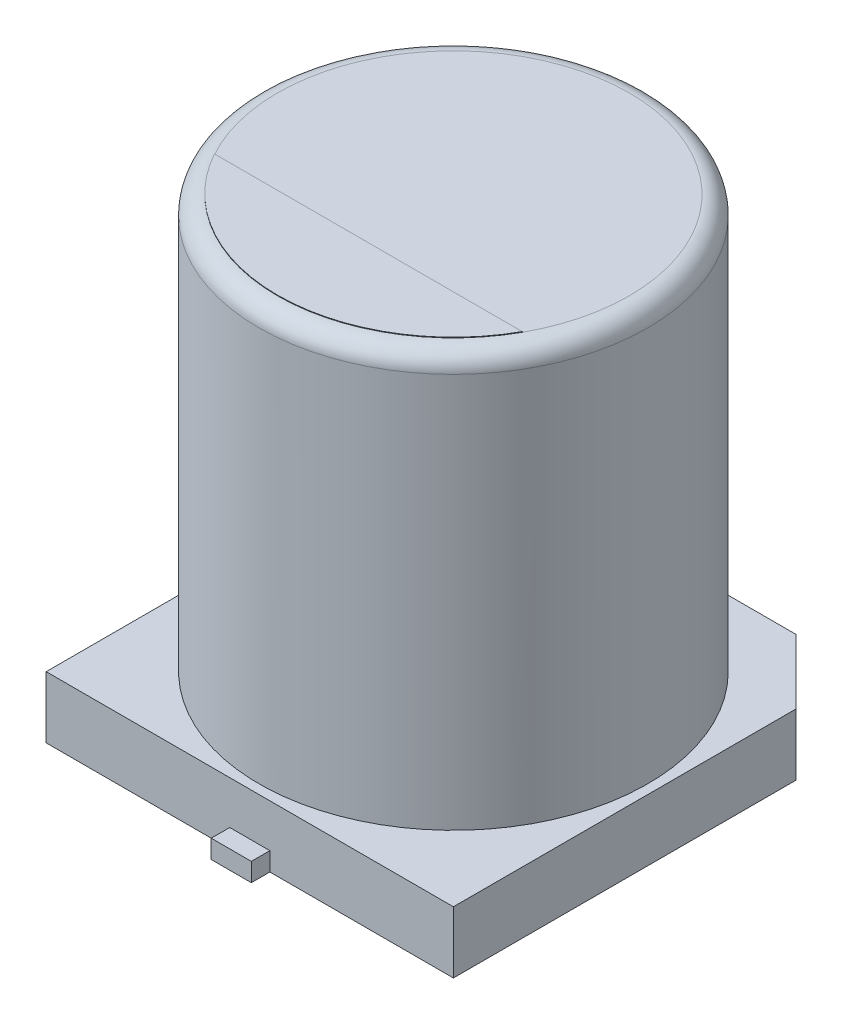
ISO-10303-21;
HEADER;
FILE_DESCRIPTION(('STEP AP214'),'2;1');
FILE_NAME('part.step','',(''),(''),'','','');
FILE_SCHEMA(('AUTOMOTIVE_DESIGN { 1 0 10303 214 1 1 1 1 }'));
ENDSEC;
DATA;
#1=APPLICATION_CONTEXT('core data for automotive mechanical design processes');
#2=APPLICATION_PROTOCOL_DEFINITION('international standard','automotive_design',2000,#1);
#3=PRODUCT_CONTEXT('',#1,'mechanical');
#4=PRODUCT('Part','Part','',(#3));
#5=PRODUCT_RELATED_PRODUCT_CATEGORY('part','',(#4));
#6=PRODUCT_DEFINITION_FORMATION('','',#4);
#7=PRODUCT_DEFINITION_CONTEXT('part definition',#1,'design');
#8=PRODUCT_DEFINITION('design','',#6,#7);
#9=PRODUCT_DEFINITION_SHAPE('','',#8);
#10=(LENGTH_UNIT() NAMED_UNIT(*) SI_UNIT(.MILLI.,.METRE.));
#11=(NAMED_UNIT(*) PLANE_ANGLE_UNIT() SI_UNIT($,.RADIAN.));
#12=(NAMED_UNIT(*) SI_UNIT($,.STERADIAN.) SOLID_ANGLE_UNIT());
#13=UNCERTAINTY_MEASURE_WITH_UNIT(LENGTH_MEASURE(1.E-05),#10,'distance_accuracy_value','');
#14=(GEOMETRIC_REPRESENTATION_CONTEXT(3) GLOBAL_UNCERTAINTY_ASSIGNED_CONTEXT((#13)) GLOBAL_UNIT_ASSIGNED_CONTEXT((#10,
#11,#12)) REPRESENTATION_CONTEXT('',''));
#15=CARTESIAN_POINT('',(0.,0.,0.));
#16=DIRECTION('',(0.,0.,1.));
#17=DIRECTION('',(1.,0.,0.));
#18=AXIS2_PLACEMENT_3D('',#15,#16,#17);
#19=CARTESIAN_POINT('',(0.,7.7,0.));
#20=DIRECTION('',(0.,1.,0.));
#21=DIRECTION('',(0.,0.,1.));
#22=AXIS2_PLACEMENT_3D('',#19,#20,#21);
#23=PLANE('',#22);
#24=CARTESIAN_POINT('',(0.,7.7,0.));
#25=DIRECTION('',(0.,1.,0.));
#26=DIRECTION('',(0.,0.,1.));
#27=AXIS2_PLACEMENT_3D('',#24,#25,#26);
#28=CIRCLE('',#27,2.85);
#29=CARTESIAN_POINT('',(2.4945818621303,7.7,1.37824574482584));
#30=VERTEX_POINT('',#29);
#31=CARTESIAN_POINT('',(-2.4945818621303,7.7,1.37824574482584));
#32=VERTEX_POINT('',#31);
#33=EDGE_CURVE('E221',#30,#32,#28,.T.);
#34=ORIENTED_EDGE('',*,*,#33,.T.);
#35=DIRECTION('',(-1.,0.,0.));
#36=VECTOR('',#35,1.);
#37=CARTESIAN_POINT('',(-2.4945818621303,7.7,1.37824574482584));
#38=LINE('',#37,#36);
#39=EDGE_CURVE('E159',#30,#32,#38,.T.);
#40=ORIENTED_EDGE('',*,*,#39,.F.);
#41=EDGE_LOOP('',(#34,#40));
#42=FACE_BOUND('',#41,.T.);
#43=ADVANCED_FACE('F33',(#42),#23,.T.);
#44=CARTESIAN_POINT('',(-2.25,1.,-3.3));
#45=DIRECTION('',(0.,0.,1.));
#46=DIRECTION('',(1.,0.,0.));
#47=AXIS2_PLACEMENT_3D('',#44,#45,#46);
#48=PLANE('',#47);
#49=DIRECTION('',(0.,-1.,0.));
#50=VECTOR('',#49,1.);
#51=CARTESIAN_POINT('',(0.325,1.,-3.3));
#52=LINE('',#51,#50);
#53=CARTESIAN_POINT('',(0.325,0.3,-3.3));
#54=VERTEX_POINT('',#53);
#55=CARTESIAN_POINT('',(0.325,0.,-3.3));
#56=VERTEX_POINT('',#55);
#57=EDGE_CURVE('E188',#54,#56,#52,.T.);
#58=ORIENTED_EDGE('',*,*,#57,.F.);
#59=DIRECTION('',(-1.,0.,0.));
#60=VECTOR('',#59,1.);
#61=CARTESIAN_POINT('',(-2.25,0.3,-3.3));
#62=LINE('',#61,#60);
#63=CARTESIAN_POINT('',(-0.325,0.3,-3.3));
#64=VERTEX_POINT('',#63);
#65=EDGE_CURVE('E11',#54,#64,#62,.T.);
#66=ORIENTED_EDGE('',*,*,#65,.T.);
#67=DIRECTION('',(0.,1.,0.));
#68=VECTOR('',#67,1.);
#69=CARTESIAN_POINT('',(-0.325,1.,-3.3));
#70=LINE('',#69,#68);
#71=CARTESIAN_POINT('',(-0.325,0.,-3.3));
#72=VERTEX_POINT('',#71);
#73=EDGE_CURVE('E186',#72,#64,#70,.T.);
#74=ORIENTED_EDGE('',*,*,#73,.F.);
#75=DIRECTION('',(-1.,0.,0.));
#76=VECTOR('',#75,1.);
#77=CARTESIAN_POINT('',(-2.25,0.,-3.3));
#78=LINE('',#77,#76);
#79=CARTESIAN_POINT('',(-2.25,0.,-3.3));
#80=VERTEX_POINT('',#79);
#81=EDGE_CURVE('E242',#72,#80,#78,.T.);
#82=ORIENTED_EDGE('',*,*,#81,.T.);
#83=DIRECTION('',(0.,-1.,0.));
#84=VECTOR('',#83,1.);
#85=CARTESIAN_POINT('',(-2.25,1.,-3.3));
#86=LINE('',#85,#84);
#87=CARTESIAN_POINT('',(-2.25,1.,-3.3));
#88=VERTEX_POINT('',#87);
#89=EDGE_CURVE('E259',#88,#80,#86,.T.);
#90=ORIENTED_EDGE('',*,*,#89,.F.);
#91=DIRECTION('',(-1.,0.,0.));
#92=VECTOR('',#91,1.);
#93=CARTESIAN_POINT('',(-2.25,1.,-3.3));
#94=LINE('',#93,#92);
#95=CARTESIAN_POINT('',(2.25,1.,-3.3));
#96=VERTEX_POINT('',#95);
#97=EDGE_CURVE('E229',#96,#88,#94,.T.);
#98=ORIENTED_EDGE('',*,*,#97,.F.);
#99=DIRECTION('',(0.,-1.,0.));
#100=VECTOR('',#99,1.);
#101=CARTESIAN_POINT('',(2.25,1.,-3.3));
#102=LINE('',#101,#100);
#103=CARTESIAN_POINT('',(2.25,0.,-3.3));
#104=VERTEX_POINT('',#103);
#105=EDGE_CURVE('E262',#96,#104,#102,.T.);
#106=ORIENTED_EDGE('',*,*,#105,.T.);
#107=EDGE_CURVE('E243',#104,#56,#78,.T.);
#108=ORIENTED_EDGE('',*,*,#107,.T.);
#109=EDGE_LOOP('',(#58,#66,#74,#82,#90,#98,#106,#108));
#110=FACE_BOUND('',#109,.T.);
#111=ADVANCED_FACE('F319',(#110),#48,.F.);
#112=CARTESIAN_POINT('',(3.3,1.,3.3));
#113=DIRECTION('',(0.,0.,-1.));
#114=DIRECTION('',(-1.,0.,0.));
#115=AXIS2_PLACEMENT_3D('',#112,#113,#114);
#116=PLANE('',#115);
#117=DIRECTION('',(0.,-1.,0.));
#118=VECTOR('',#117,1.);
#119=CARTESIAN_POINT('',(-0.325,1.,3.3));
#120=LINE('',#119,#118);
#121=CARTESIAN_POINT('',(-0.325,0.3,3.3));
#122=VERTEX_POINT('',#121);
#123=CARTESIAN_POINT('',(-0.325,0.,3.3));
#124=VERTEX_POINT('',#123);
#125=EDGE_CURVE('E214',#122,#124,#120,.T.);
#126=ORIENTED_EDGE('',*,*,#125,.F.);
#127=DIRECTION('',(-1.,0.,0.));
#128=VECTOR('',#127,1.);
#129=CARTESIAN_POINT('',(3.3,0.3,3.3));
#130=LINE('',#129,#128);
#131=CARTESIAN_POINT('',(0.325,0.3,3.3));
#132=VERTEX_POINT('',#131);
#133=EDGE_CURVE('E41',#132,#122,#130,.T.);
#134=ORIENTED_EDGE('',*,*,#133,.F.);
#135=DIRECTION('',(0.,1.,0.));
#136=VECTOR('',#135,1.);
#137=CARTESIAN_POINT('',(0.325,1.,3.3));
#138=LINE('',#137,#136);
#139=CARTESIAN_POINT('',(0.325,0.,3.3));
#140=VERTEX_POINT('',#139);
#141=EDGE_CURVE('E211',#140,#132,#138,.T.);
#142=ORIENTED_EDGE('',*,*,#141,.F.);
#143=DIRECTION('',(1.,0.,0.));
#144=VECTOR('',#143,1.);
#145=CARTESIAN_POINT('',(3.3,0.,3.3));
#146=LINE('',#145,#144);
#147=CARTESIAN_POINT('',(3.3,0.,3.3));
#148=VERTEX_POINT('',#147);
#149=EDGE_CURVE('E249',#140,#148,#146,.T.);
#150=ORIENTED_EDGE('',*,*,#149,.T.);
#151=DIRECTION('',(0.,-1.,0.));
#152=VECTOR('',#151,1.);
#153=CARTESIAN_POINT('',(3.3,1.,3.3));
#154=LINE('',#153,#152);
#155=CARTESIAN_POINT('',(3.3,1.,3.3));
#156=VERTEX_POINT('',#155);
#157=EDGE_CURVE('E237',#156,#148,#154,.T.);
#158=ORIENTED_EDGE('',*,*,#157,.F.);
#159=DIRECTION('',(1.,0.,0.));
#160=VECTOR('',#159,1.);
#161=CARTESIAN_POINT('',(3.3,1.,3.3));
#162=LINE('',#161,#160);
#163=CARTESIAN_POINT('',(-3.3,1.,3.3));
#164=VERTEX_POINT('',#163);
#165=EDGE_CURVE('E235',#164,#156,#162,.T.);
#166=ORIENTED_EDGE('',*,*,#165,.F.);
#167=DIRECTION('',(0.,-1.,0.));
#168=VECTOR('',#167,1.);
#169=CARTESIAN_POINT('',(-3.3,1.,3.3));
#170=LINE('',#169,#168);
#171=CARTESIAN_POINT('',(-3.3,0.,3.3));
#172=VERTEX_POINT('',#171);
#173=EDGE_CURVE('E253',#164,#172,#170,.T.);
#174=ORIENTED_EDGE('',*,*,#173,.T.);
#175=EDGE_CURVE('E227',#172,#124,#146,.T.);
#176=ORIENTED_EDGE('',*,*,#175,.T.);
#177=EDGE_LOOP('',(#126,#134,#142,#150,#158,#166,#174,#176));
#178=FACE_BOUND('',#177,.T.);
#179=ADVANCED_FACE('F289',(#178),#116,.F.);
#180=CARTESIAN_POINT('',(3.3,1.,-2.25));
#181=DIRECTION('',(-1.,0.,0.));
#182=DIRECTION('',(0.,0.,1.));
#183=AXIS2_PLACEMENT_3D('',#180,#181,#182);
#184=PLANE('',#183);
#185=DIRECTION('',(0.,0.,-1.));
#186=VECTOR('',#185,1.);
#187=CARTESIAN_POINT('',(3.3,0.,-2.25));
#188=LINE('',#187,#186);
#189=CARTESIAN_POINT('',(3.3,0.,-2.25));
#190=VERTEX_POINT('',#189);
#191=EDGE_CURVE('E217',#148,#190,#188,.T.);
#192=ORIENTED_EDGE('',*,*,#191,.T.);
#193=DIRECTION('',(0.,-1.,0.));
#194=VECTOR('',#193,1.);
#195=CARTESIAN_POINT('',(3.3,1.,-2.25));
#196=LINE('',#195,#194);
#197=CARTESIAN_POINT('',(3.3,1.,-2.25));
#198=VERTEX_POINT('',#197);
#199=EDGE_CURVE('E222',#198,#190,#196,.T.);
#200=ORIENTED_EDGE('',*,*,#199,.F.);
#201=DIRECTION('',(0.,0.,-1.));
#202=VECTOR('',#201,1.);
#203=CARTESIAN_POINT('',(3.3,1.,-2.25));
#204=LINE('',#203,#202);
#205=EDGE_CURVE('E223',#156,#198,#204,.T.);
#206=ORIENTED_EDGE('',*,*,#205,.F.);
#207=ORIENTED_EDGE('',*,*,#157,.T.);
#208=EDGE_LOOP('',(#192,#200,#206,#207));
#209=FACE_BOUND('',#208,.T.);
#210=ADVANCED_FACE('F296',(#209),#184,.F.);
#211=CARTESIAN_POINT('',(2.25,1.,-3.3));
#212=DIRECTION('',(-0.707106781186548,0.,0.707106781186547));
#213=DIRECTION('',(0.707106781186547,0.,0.707106781186548));
#214=AXIS2_PLACEMENT_3D('',#211,#212,#213);
#215=PLANE('',#214);
#216=DIRECTION('',(-0.707106781186547,0.,-0.707106781186548));
#217=VECTOR('',#216,1.);
#218=CARTESIAN_POINT('',(2.25,0.,-3.3));
#219=LINE('',#218,#217);
#220=EDGE_CURVE('E240',#190,#104,#219,.T.);
#221=ORIENTED_EDGE('',*,*,#220,.T.);
#222=ORIENTED_EDGE('',*,*,#105,.F.);
#223=DIRECTION('',(-0.707106781186547,0.,-0.707106781186548));
#224=VECTOR('',#223,1.);
#225=CARTESIAN_POINT('',(2.25,1.,-3.3));
#226=LINE('',#225,#224);
#227=EDGE_CURVE('E226',#198,#96,#226,.T.);
#228=ORIENTED_EDGE('',*,*,#227,.F.);
#229=ORIENTED_EDGE('',*,*,#199,.T.);
#230=EDGE_LOOP('',(#221,#222,#228,#229));
#231=FACE_BOUND('',#230,.T.);
#232=ADVANCED_FACE('F303',(#231),#215,.F.);
#233=CARTESIAN_POINT('',(-3.3,1.,-2.25));
#234=DIRECTION('',(0.707106781186547,0.,0.707106781186547));
#235=DIRECTION('',(0.707106781186548,0.,-0.707106781186548));
#236=AXIS2_PLACEMENT_3D('',#233,#234,#235);
#237=PLANE('',#236);
#238=DIRECTION('',(-0.707106781186548,0.,0.707106781186548));
#239=VECTOR('',#238,1.);
#240=CARTESIAN_POINT('',(-3.3,0.,-2.25));
#241=LINE('',#240,#239);
#242=CARTESIAN_POINT('',(-3.3,0.,-2.25));
#243=VERTEX_POINT('',#242);
#244=EDGE_CURVE('E245',#80,#243,#241,.T.);
#245=ORIENTED_EDGE('',*,*,#244,.T.);
#246=DIRECTION('',(0.,-1.,0.));
#247=VECTOR('',#246,1.);
#248=CARTESIAN_POINT('',(-3.3,1.,-2.25));
#249=LINE('',#248,#247);
#250=CARTESIAN_POINT('',(-3.3,1.,-2.25));
#251=VERTEX_POINT('',#250);
#252=EDGE_CURVE('E256',#251,#243,#249,.T.);
#253=ORIENTED_EDGE('',*,*,#252,.F.);
#254=DIRECTION('',(-0.707106781186548,0.,0.707106781186548));
#255=VECTOR('',#254,1.);
#256=CARTESIAN_POINT('',(-3.3,1.,-2.25));
#257=LINE('',#256,#255);
#258=EDGE_CURVE('E231',#88,#251,#257,.T.);
#259=ORIENTED_EDGE('',*,*,#258,.F.);
#260=ORIENTED_EDGE('',*,*,#89,.T.);
#261=EDGE_LOOP('',(#245,#253,#259,#260));
#262=FACE_BOUND('',#261,.T.);
#263=ADVANCED_FACE('F317',(#262),#237,.F.);
#264=CARTESIAN_POINT('',(-3.3,1.,3.3));
#265=DIRECTION('',(1.,0.,0.));
#266=DIRECTION('',(0.,0.,-1.));
#267=AXIS2_PLACEMENT_3D('',#264,#265,#266);
#268=PLANE('',#267);
#269=DIRECTION('',(0.,0.,1.));
#270=VECTOR('',#269,1.);
#271=CARTESIAN_POINT('',(-3.3,0.,3.3));
#272=LINE('',#271,#270);
#273=EDGE_CURVE('E247',#243,#172,#272,.T.);
#274=ORIENTED_EDGE('',*,*,#273,.T.);
#275=ORIENTED_EDGE('',*,*,#173,.F.);
#276=DIRECTION('',(0.,0.,1.));
#277=VECTOR('',#276,1.);
#278=CARTESIAN_POINT('',(-3.3,1.,3.3));
#279=LINE('',#278,#277);
#280=EDGE_CURVE('E233',#251,#164,#279,.T.);
#281=ORIENTED_EDGE('',*,*,#280,.F.);
#282=ORIENTED_EDGE('',*,*,#252,.T.);
#283=EDGE_LOOP('',(#274,#275,#281,#282));
#284=FACE_BOUND('',#283,.T.);
#285=ADVANCED_FACE('F313',(#284),#268,.F.);
#286=CARTESIAN_POINT('',(0.,1.,0.));
#287=DIRECTION('',(0.,-1.,0.));
#288=DIRECTION('',(0.,0.,-1.));
#289=AXIS2_PLACEMENT_3D('',#286,#287,#288);
#290=PLANE('',#289);
#291=CARTESIAN_POINT('',(0.,1.,0.));
#292=DIRECTION('',(0.,-1.,0.));
#293=DIRECTION('',(0.,0.,-1.));
#294=AXIS2_PLACEMENT_3D('',#291,#292,#293);
#295=CIRCLE('',#294,3.15);
#296=CARTESIAN_POINT('',(0.,1.,-3.15));
#297=VERTEX_POINT('',#296);
#298=EDGE_CURVE('E218',#297,#297,#295,.F.);
#299=ORIENTED_EDGE('',*,*,#298,.F.);
#300=EDGE_LOOP('',(#299));
#301=FACE_BOUND('',#300,.T.);
#302=ORIENTED_EDGE('',*,*,#205,.T.);
#303=ORIENTED_EDGE('',*,*,#227,.T.);
#304=ORIENTED_EDGE('',*,*,#97,.T.);
#305=ORIENTED_EDGE('',*,*,#258,.T.);
#306=ORIENTED_EDGE('',*,*,#280,.T.);
#307=ORIENTED_EDGE('',*,*,#165,.T.);
#308=EDGE_LOOP('',(#302,#303,#304,#305,#306,#307));
#309=FACE_BOUND('',#308,.T.);
#310=ADVANCED_FACE('F306',(#301,#309),#290,.F.);
#311=CARTESIAN_POINT('',(0.,0.,0.));
#312=DIRECTION('',(0.,-1.,0.));
#313=DIRECTION('',(0.,0.,-1.));
#314=AXIS2_PLACEMENT_3D('',#311,#312,#313);
#315=PLANE('',#314);
#316=ORIENTED_EDGE('',*,*,#81,.F.);
#317=DIRECTION('',(0.,0.,1.));
#318=VECTOR('',#317,1.);
#319=CARTESIAN_POINT('',(-0.325,0.,-0.8));
#320=LINE('',#319,#318);
#321=CARTESIAN_POINT('',(-0.325,0.,-3.6));
#322=VERTEX_POINT('',#321);
#323=EDGE_CURVE('E172',#322,#72,#320,.T.);
#324=ORIENTED_EDGE('',*,*,#323,.F.);
#325=DIRECTION('',(-1.,0.,0.));
#326=VECTOR('',#325,1.);
#327=CARTESIAN_POINT('',(0.325,0.,-3.6));
#328=LINE('',#327,#326);
#329=CARTESIAN_POINT('',(0.325,0.,-3.6));
#330=VERTEX_POINT('',#329);
#331=EDGE_CURVE('E164',#330,#322,#328,.T.);
#332=ORIENTED_EDGE('',*,*,#331,.F.);
#333=DIRECTION('',(0.,0.,-1.));
#334=VECTOR('',#333,1.);
#335=CARTESIAN_POINT('',(0.325,0.,-0.8));
#336=LINE('',#335,#334);
#337=EDGE_CURVE('E162',#56,#330,#336,.T.);
#338=ORIENTED_EDGE('',*,*,#337,.F.);
#339=ORIENTED_EDGE('',*,*,#107,.F.);
#340=ORIENTED_EDGE('',*,*,#220,.F.);
#341=ORIENTED_EDGE('',*,*,#191,.F.);
#342=ORIENTED_EDGE('',*,*,#149,.F.);
#343=DIRECTION('',(0.,0.,-1.));
#344=VECTOR('',#343,1.);
#345=CARTESIAN_POINT('',(0.325,0.,0.8));
#346=LINE('',#345,#344);
#347=CARTESIAN_POINT('',(0.325,0.,3.6));
#348=VERTEX_POINT('',#347);
#349=EDGE_CURVE('E195',#348,#140,#346,.T.);
#350=ORIENTED_EDGE('',*,*,#349,.F.);
#351=DIRECTION('',(1.,0.,0.));
#352=VECTOR('',#351,1.);
#353=CARTESIAN_POINT('',(0.325,0.,3.6));
#354=LINE('',#353,#352);
#355=CARTESIAN_POINT('',(-0.325,0.,3.6));
#356=VERTEX_POINT('',#355);
#357=EDGE_CURVE('E202',#356,#348,#354,.T.);
#358=ORIENTED_EDGE('',*,*,#357,.F.);
#359=DIRECTION('',(0.,0.,1.));
#360=VECTOR('',#359,1.);
#361=CARTESIAN_POINT('',(-0.325,0.,0.8));
#362=LINE('',#361,#360);
#363=EDGE_CURVE('E191',#124,#356,#362,.T.);
#364=ORIENTED_EDGE('',*,*,#363,.F.);
#365=ORIENTED_EDGE('',*,*,#175,.F.);
#366=ORIENTED_EDGE('',*,*,#273,.F.);
#367=ORIENTED_EDGE('',*,*,#244,.F.);
#368=EDGE_LOOP('',(#316,#324,#332,#338,#339,#340,#341,#342,#350,#358,#364,#365,#366,#367));
#369=FACE_BOUND('',#368,.T.);
#370=ADVANCED_FACE('F298',(#369),#315,.T.);
#371=CARTESIAN_POINT('',(0.,7.7,0.));
#372=DIRECTION('',(0.,-1.,0.));
#373=DIRECTION('',(0.,0.,-1.));
#374=AXIS2_PLACEMENT_3D('',#371,#372,#373);
#375=CYLINDRICAL_SURFACE('',#374,3.15);
#376=CARTESIAN_POINT('',(0.,7.4,0.));
#377=DIRECTION('',(0.,1.,0.));
#378=DIRECTION('',(0.,0.,1.));
#379=AXIS2_PLACEMENT_3D('',#376,#377,#378);
#380=CIRCLE('',#379,3.15);
#381=CARTESIAN_POINT('',(0.,7.4,3.15));
#382=VERTEX_POINT('',#381);
#383=EDGE_CURVE('E268',#382,#382,#380,.F.);
#384=ORIENTED_EDGE('',*,*,#383,.T.);
#385=EDGE_LOOP('',(#384));
#386=FACE_BOUND('',#385,.T.);
#387=ORIENTED_EDGE('',*,*,#298,.T.);
#388=EDGE_LOOP('',(#387));
#389=FACE_BOUND('',#388,.T.);
#390=ADVANCED_FACE('F354',(#386,#389),#375,.T.);
#391=CARTESIAN_POINT('',(0.,7.4,0.));
#392=DIRECTION('',(0.,1.,0.));
#393=DIRECTION('',(0.,0.,1.));
#394=AXIS2_PLACEMENT_3D('',#391,#392,#393);
#395=TOROIDAL_SURFACE('',#394,2.85,0.3);
#396=ORIENTED_EDGE('',*,*,#383,.F.);
#397=EDGE_LOOP('',(#396));
#398=FACE_BOUND('',#397,.T.);
#399=ORIENTED_EDGE('',*,*,#33,.F.);
#400=CARTESIAN_POINT('',(0.,7.7,0.));
#401=DIRECTION('',(0.,1.,0.));
#402=DIRECTION('',(0.,0.,1.));
#403=AXIS2_PLACEMENT_3D('',#400,#401,#402);
#404=CIRCLE('',#403,2.85);
#405=EDGE_CURVE('E47',#32,#30,#404,.T.);
#406=ORIENTED_EDGE('',*,*,#405,.F.);
#407=EDGE_LOOP('',(#399,#406));
#408=FACE_BOUND('',#407,.T.);
#409=ADVANCED_FACE('F35',(#398,#408),#395,.T.);
#410=CARTESIAN_POINT('',(0.,0.3,0.));
#411=DIRECTION('',(0.,-1.,0.));
#412=DIRECTION('',(0.,0.,-1.));
#413=AXIS2_PLACEMENT_3D('',#410,#411,#412);
#414=PLANE('',#413);
#415=DIRECTION('',(0.,0.,-1.));
#416=VECTOR('',#415,1.);
#417=CARTESIAN_POINT('',(0.325,0.3,0.8));
#418=LINE('',#417,#416);
#419=CARTESIAN_POINT('',(0.325,0.3,3.6));
#420=VERTEX_POINT('',#419);
#421=EDGE_CURVE('E197',#420,#132,#418,.T.);
#422=ORIENTED_EDGE('',*,*,#421,.T.);
#423=ORIENTED_EDGE('',*,*,#133,.T.);
#424=DIRECTION('',(0.,0.,1.));
#425=VECTOR('',#424,1.);
#426=CARTESIAN_POINT('',(-0.325,0.3,0.8));
#427=LINE('',#426,#425);
#428=CARTESIAN_POINT('',(-0.325,0.3,3.6));
#429=VERTEX_POINT('',#428);
#430=EDGE_CURVE('E192',#122,#429,#427,.T.);
#431=ORIENTED_EDGE('',*,*,#430,.T.);
#432=DIRECTION('',(1.,0.,0.));
#433=VECTOR('',#432,1.);
#434=CARTESIAN_POINT('',(0.325,0.3,3.6));
#435=LINE('',#434,#433);
#436=EDGE_CURVE('E194',#429,#420,#435,.T.);
#437=ORIENTED_EDGE('',*,*,#436,.T.);
#438=EDGE_LOOP('',(#422,#423,#431,#437));
#439=FACE_BOUND('',#438,.T.);
#440=ADVANCED_FACE('F273',(#439),#414,.F.);
#441=CARTESIAN_POINT('',(-0.325,0.3,0.8));
#442=DIRECTION('',(1.,0.,0.));
#443=DIRECTION('',(0.,0.,-1.));
#444=AXIS2_PLACEMENT_3D('',#441,#442,#443);
#445=PLANE('',#444);
#446=ORIENTED_EDGE('',*,*,#430,.F.);
#447=ORIENTED_EDGE('',*,*,#125,.T.);
#448=ORIENTED_EDGE('',*,*,#363,.T.);
#449=DIRECTION('',(0.,-1.,0.));
#450=VECTOR('',#449,1.);
#451=CARTESIAN_POINT('',(-0.325,0.3,3.6));
#452=LINE('',#451,#450);
#453=EDGE_CURVE('E208',#429,#356,#452,.T.);
#454=ORIENTED_EDGE('',*,*,#453,.F.);
#455=EDGE_LOOP('',(#446,#447,#448,#454));
#456=FACE_BOUND('',#455,.T.);
#457=ADVANCED_FACE('F280',(#456),#445,.F.);
#458=CARTESIAN_POINT('',(0.325,0.3,0.8));
#459=DIRECTION('',(-1.,0.,0.));
#460=DIRECTION('',(0.,0.,1.));
#461=AXIS2_PLACEMENT_3D('',#458,#459,#460);
#462=PLANE('',#461);
#463=ORIENTED_EDGE('',*,*,#349,.T.);
#464=ORIENTED_EDGE('',*,*,#141,.T.);
#465=ORIENTED_EDGE('',*,*,#421,.F.);
#466=DIRECTION('',(0.,-1.,0.));
#467=VECTOR('',#466,1.);
#468=CARTESIAN_POINT('',(0.325,0.3,3.6));
#469=LINE('',#468,#467);
#470=EDGE_CURVE('E200',#420,#348,#469,.T.);
#471=ORIENTED_EDGE('',*,*,#470,.T.);
#472=EDGE_LOOP('',(#463,#464,#465,#471));
#473=FACE_BOUND('',#472,.T.);
#474=ADVANCED_FACE('F288',(#473),#462,.F.);
#475=CARTESIAN_POINT('',(0.325,0.3,3.6));
#476=DIRECTION('',(0.,0.,-1.));
#477=DIRECTION('',(-1.,0.,0.));
#478=AXIS2_PLACEMENT_3D('',#475,#476,#477);
#479=PLANE('',#478);
#480=ORIENTED_EDGE('',*,*,#357,.T.);
#481=ORIENTED_EDGE('',*,*,#470,.F.);
#482=ORIENTED_EDGE('',*,*,#436,.F.);
#483=ORIENTED_EDGE('',*,*,#453,.T.);
#484=EDGE_LOOP('',(#480,#481,#482,#483));
#485=FACE_BOUND('',#484,.T.);
#486=ADVANCED_FACE('F284',(#485),#479,.F.);
#487=CARTESIAN_POINT('',(0.,0.3,0.));
#488=DIRECTION('',(0.,1.,0.));
#489=DIRECTION('',(0.,0.,1.));
#490=AXIS2_PLACEMENT_3D('',#487,#488,#489);
#491=PLANE('',#490);
#492=ORIENTED_EDGE('',*,*,#65,.F.);
#493=DIRECTION('',(0.,0.,-1.));
#494=VECTOR('',#493,1.);
#495=CARTESIAN_POINT('',(0.325,0.3,-0.8));
#496=LINE('',#495,#494);
#497=CARTESIAN_POINT('',(0.325,0.3,-3.6));
#498=VERTEX_POINT('',#497);
#499=EDGE_CURVE('E169',#54,#498,#496,.T.);
#500=ORIENTED_EDGE('',*,*,#499,.T.);
#501=DIRECTION('',(-1.,0.,0.));
#502=VECTOR('',#501,1.);
#503=CARTESIAN_POINT('',(0.325,0.3,-3.6));
#504=LINE('',#503,#502);
#505=CARTESIAN_POINT('',(-0.325,0.3,-3.6));
#506=VERTEX_POINT('',#505);
#507=EDGE_CURVE('E171',#498,#506,#504,.T.);
#508=ORIENTED_EDGE('',*,*,#507,.T.);
#509=DIRECTION('',(0.,0.,1.));
#510=VECTOR('',#509,1.);
#511=CARTESIAN_POINT('',(-0.325,0.3,-0.8));
#512=LINE('',#511,#510);
#513=EDGE_CURVE('E174',#506,#64,#512,.T.);
#514=ORIENTED_EDGE('',*,*,#513,.T.);
#515=EDGE_LOOP('',(#492,#500,#508,#514));
#516=FACE_BOUND('',#515,.T.);
#517=ADVANCED_FACE('F334',(#516),#491,.T.);
#518=CARTESIAN_POINT('',(0.325,0.3,-0.8));
#519=DIRECTION('',(-1.,0.,0.));
#520=DIRECTION('',(0.,0.,1.));
#521=AXIS2_PLACEMENT_3D('',#518,#519,#520);
#522=PLANE('',#521);
#523=ORIENTED_EDGE('',*,*,#499,.F.);
#524=ORIENTED_EDGE('',*,*,#57,.T.);
#525=ORIENTED_EDGE('',*,*,#337,.T.);
#526=DIRECTION('',(0.,-1.,0.));
#527=VECTOR('',#526,1.);
#528=CARTESIAN_POINT('',(0.325,0.3,-3.6));
#529=LINE('',#528,#527);
#530=EDGE_CURVE('E183',#498,#330,#529,.T.);
#531=ORIENTED_EDGE('',*,*,#530,.F.);
#532=EDGE_LOOP('',(#523,#524,#525,#531));
#533=FACE_BOUND('',#532,.T.);
#534=ADVANCED_FACE('F332',(#533),#522,.F.);
#535=CARTESIAN_POINT('',(-0.325,0.3,-0.8));
#536=DIRECTION('',(1.,0.,0.));
#537=DIRECTION('',(0.,0.,-1.));
#538=AXIS2_PLACEMENT_3D('',#535,#536,#537);
#539=PLANE('',#538);
#540=ORIENTED_EDGE('',*,*,#323,.T.);
#541=ORIENTED_EDGE('',*,*,#73,.T.);
#542=ORIENTED_EDGE('',*,*,#513,.F.);
#543=DIRECTION('',(0.,-1.,0.));
#544=VECTOR('',#543,1.);
#545=CARTESIAN_POINT('',(-0.325,0.3,-3.6));
#546=LINE('',#545,#544);
#547=EDGE_CURVE('E176',#506,#322,#546,.T.);
#548=ORIENTED_EDGE('',*,*,#547,.T.);
#549=EDGE_LOOP('',(#540,#541,#542,#548));
#550=FACE_BOUND('',#549,.T.);
#551=ADVANCED_FACE('F323',(#550),#539,.F.);
#552=CARTESIAN_POINT('',(0.325,0.3,-3.6));
#553=DIRECTION('',(0.,0.,1.));
#554=DIRECTION('',(1.,0.,0.));
#555=AXIS2_PLACEMENT_3D('',#552,#553,#554);
#556=PLANE('',#555);
#557=ORIENTED_EDGE('',*,*,#331,.T.);
#558=ORIENTED_EDGE('',*,*,#547,.F.);
#559=ORIENTED_EDGE('',*,*,#507,.F.);
#560=ORIENTED_EDGE('',*,*,#530,.T.);
#561=EDGE_LOOP('',(#557,#558,#559,#560));
#562=FACE_BOUND('',#561,.T.);
#563=ADVANCED_FACE('F328',(#562),#556,.F.);
#564=CARTESIAN_POINT('',(0.,7.71,0.));
#565=DIRECTION('',(0.,-1.,0.));
#566=DIRECTION('',(0.,0.,-1.));
#567=AXIS2_PLACEMENT_3D('',#564,#565,#566);
#568=CYLINDRICAL_SURFACE('',#567,2.85);
#569=ORIENTED_EDGE('',*,*,#405,.T.);
#570=DIRECTION('',(0.,-1.,0.));
#571=VECTOR('',#570,1.);
#572=CARTESIAN_POINT('',(2.4945818621303,7.71,1.37824574482584));
#573=LINE('',#572,#571);
#574=CARTESIAN_POINT('',(2.4945818621303,7.71,1.37824574482584));
#575=VERTEX_POINT('',#574);
#576=EDGE_CURVE('E150',#575,#30,#573,.T.);
#577=ORIENTED_EDGE('',*,*,#576,.F.);
#578=CARTESIAN_POINT('',(0.,7.71,0.));
#579=DIRECTION('',(0.,1.,0.));
#580=DIRECTION('',(0.,0.,1.));
#581=AXIS2_PLACEMENT_3D('',#578,#579,#580);
#582=CIRCLE('',#581,2.85);
#583=CARTESIAN_POINT('',(-2.4945818621303,7.71,1.37824574482584));
#584=VERTEX_POINT('',#583);
#585=EDGE_CURVE('E155',#584,#575,#582,.T.);
#586=ORIENTED_EDGE('',*,*,#585,.F.);
#587=DIRECTION('',(0.,-1.,0.));
#588=VECTOR('',#587,1.);
#589=CARTESIAN_POINT('',(-2.4945818621303,7.71,1.37824574482584));
#590=LINE('',#589,#588);
#591=EDGE_CURVE('E152',#584,#32,#590,.T.);
#592=ORIENTED_EDGE('',*,*,#591,.T.);
#593=EDGE_LOOP('',(#569,#577,#586,#592));
#594=FACE_BOUND('',#593,.T.);
#595=ADVANCED_FACE('F161',(#594),#568,.T.);
#596=CARTESIAN_POINT('',(-2.4945818621303,7.71,1.37824574482584));
#597=DIRECTION('',(0.,0.,1.));
#598=DIRECTION('',(1.,0.,0.));
#599=AXIS2_PLACEMENT_3D('',#596,#597,#598);
#600=PLANE('',#599);
#601=ORIENTED_EDGE('',*,*,#39,.T.);
#602=ORIENTED_EDGE('',*,*,#591,.F.);
#603=DIRECTION('',(-1.,0.,0.));
#604=VECTOR('',#603,1.);
#605=CARTESIAN_POINT('',(-2.4945818621303,7.71,1.37824574482584));
#606=LINE('',#605,#604);
#607=EDGE_CURVE('E145',#575,#584,#606,.T.);
#608=ORIENTED_EDGE('',*,*,#607,.F.);
#609=ORIENTED_EDGE('',*,*,#576,.T.);
#610=EDGE_LOOP('',(#601,#602,#608,#609));
#611=FACE_BOUND('',#610,.T.);
#612=ADVANCED_FACE('F148',(#611),#600,.F.);
#613=CARTESIAN_POINT('',(0.,7.71,0.));
#614=DIRECTION('',(0.,1.,0.));
#615=DIRECTION('',(0.,0.,1.));
#616=AXIS2_PLACEMENT_3D('',#613,#614,#615);
#617=PLANE('',#616);
#618=ORIENTED_EDGE('',*,*,#585,.T.);
#619=ORIENTED_EDGE('',*,*,#607,.T.);
#620=EDGE_LOOP('',(#618,#619));
#621=FACE_BOUND('',#620,.T.);
#622=ADVANCED_FACE('F157',(#621),#617,.T.);
#623=CLOSED_SHELL('',(#43,#111,#179,#210,#232,#263,#285,#310,#370,#390,#409,#440,#457,#474,#486,
#517,#534,#551,#563,#595,#612,#622));
#624=MANIFOLD_SOLID_BREP('B2',#623);
#625=ADVANCED_BREP_SHAPE_REPRESENTATION('',(#18,#624),#14);
#626=SHAPE_DEFINITION_REPRESENTATION(#9,#625);
ENDSEC;
END-ISO-10303-21;
